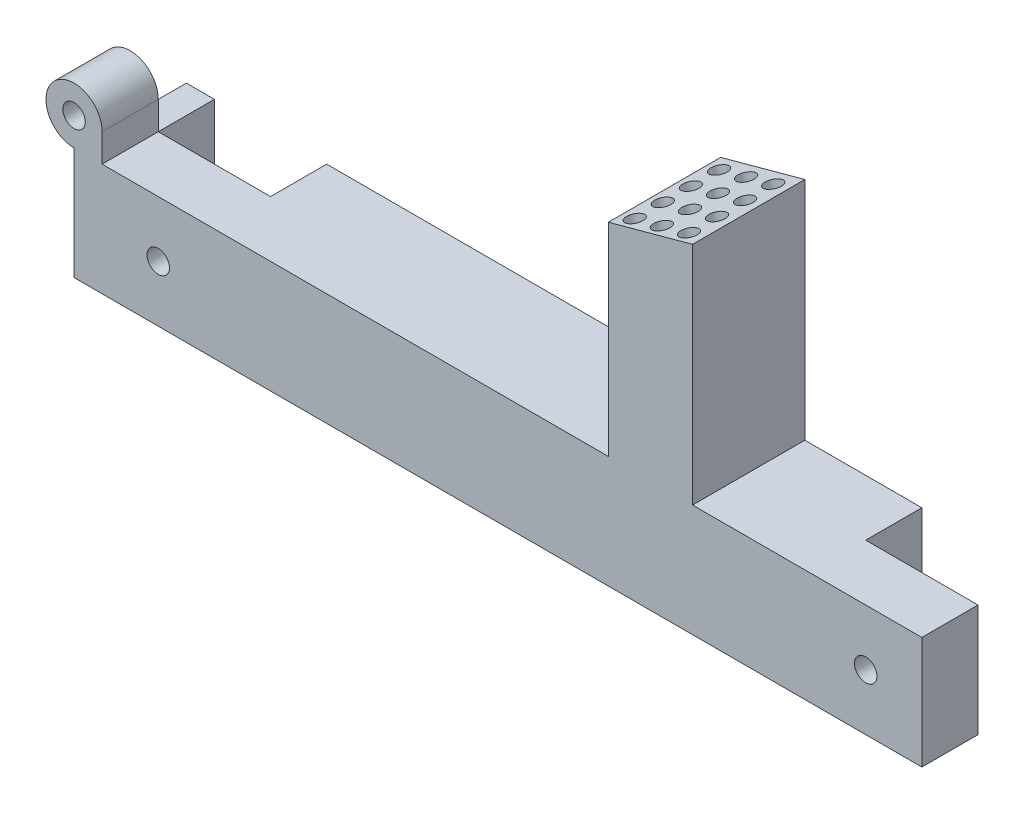
ISO-10303-21;
HEADER;
FILE_DESCRIPTION(('STEP AP214'),'2;1');
FILE_NAME('part.step','',(''),(''),'','','');
FILE_SCHEMA(('AUTOMOTIVE_DESIGN { 1 0 10303 214 1 1 1 1 }'));
ENDSEC;
DATA;
#1=APPLICATION_CONTEXT('core data for automotive mechanical design processes');
#2=APPLICATION_PROTOCOL_DEFINITION('international standard','automotive_design',2000,#1);
#3=PRODUCT_CONTEXT('',#1,'mechanical');
#4=PRODUCT('Part','Part','',(#3));
#5=PRODUCT_RELATED_PRODUCT_CATEGORY('part','',(#4));
#6=PRODUCT_DEFINITION_FORMATION('','',#4);
#7=PRODUCT_DEFINITION_CONTEXT('part definition',#1,'design');
#8=PRODUCT_DEFINITION('design','',#6,#7);
#9=PRODUCT_DEFINITION_SHAPE('','',#8);
#10=(LENGTH_UNIT() NAMED_UNIT(*) SI_UNIT(.MILLI.,.METRE.));
#11=(NAMED_UNIT(*) PLANE_ANGLE_UNIT() SI_UNIT($,.RADIAN.));
#12=(NAMED_UNIT(*) SI_UNIT($,.STERADIAN.) SOLID_ANGLE_UNIT());
#13=UNCERTAINTY_MEASURE_WITH_UNIT(LENGTH_MEASURE(1.E-05),#10,'distance_accuracy_value','');
#14=(GEOMETRIC_REPRESENTATION_CONTEXT(3) GLOBAL_UNCERTAINTY_ASSIGNED_CONTEXT((#13)) GLOBAL_UNIT_ASSIGNED_CONTEXT((#10,
#11,#12)) REPRESENTATION_CONTEXT('',''));
#15=CARTESIAN_POINT('',(0.,0.,0.));
#16=DIRECTION('',(0.,0.,1.));
#17=DIRECTION('',(1.,0.,0.));
#18=AXIS2_PLACEMENT_3D('',#15,#16,#17);
#19=CARTESIAN_POINT('',(-122.5,20.,20.));
#20=DIRECTION('',(0.,-1.,0.));
#21=DIRECTION('',(1.,0.,0.));
#22=AXIS2_PLACEMENT_3D('',#19,#20,#21);
#23=PLANE('',#22);
#24=DIRECTION('',(-1.,0.,0.));
#25=VECTOR('',#24,1.);
#26=CARTESIAN_POINT('',(-122.5,20.,0.));
#27=LINE('',#26,#25);
#28=CARTESIAN_POINT('',(126.,20.,0.));
#29=VERTEX_POINT('',#28);
#30=CARTESIAN_POINT('',(105.163576310592,20.,0.));
#31=VERTEX_POINT('',#30);
#32=EDGE_CURVE('E287',#29,#31,#27,.T.);
#33=ORIENTED_EDGE('',*,*,#32,.T.);
#34=DIRECTION('',(0.,0.,1.));
#35=VECTOR('',#34,1.);
#36=CARTESIAN_POINT('',(105.163576310592,20.,-42.9228270218909));
#37=LINE('',#36,#35);
#38=CARTESIAN_POINT('',(105.163576310592,20.,20.));
#39=VERTEX_POINT('',#38);
#40=EDGE_CURVE('E59',#31,#39,#37,.T.);
#41=ORIENTED_EDGE('',*,*,#40,.T.);
#42=DIRECTION('',(-1.,0.,0.));
#43=VECTOR('',#42,1.);
#44=CARTESIAN_POINT('',(-122.5,20.,20.));
#45=LINE('',#44,#43);
#46=CARTESIAN_POINT('',(146.,20.,20.));
#47=VERTEX_POINT('',#46);
#48=EDGE_CURVE('E281',#47,#39,#45,.T.);
#49=ORIENTED_EDGE('',*,*,#48,.F.);
#50=DIRECTION('',(0.,0.,1.));
#51=VECTOR('',#50,1.);
#52=CARTESIAN_POINT('',(146.,20.,-147.363496158309));
#53=LINE('',#52,#51);
#54=CARTESIAN_POINT('',(146.,20.,10.));
#55=VERTEX_POINT('',#54);
#56=EDGE_CURVE('E216',#55,#47,#53,.T.);
#57=ORIENTED_EDGE('',*,*,#56,.F.);
#58=DIRECTION('',(1.,0.,0.));
#59=VECTOR('',#58,1.);
#60=CARTESIAN_POINT('',(146.,20.,10.));
#61=LINE('',#60,#59);
#62=CARTESIAN_POINT('',(126.,20.,10.));
#63=VERTEX_POINT('',#62);
#64=EDGE_CURVE('E252',#63,#55,#61,.T.);
#65=ORIENTED_EDGE('',*,*,#64,.F.);
#66=DIRECTION('',(0.,0.,1.));
#67=VECTOR('',#66,1.);
#68=CARTESIAN_POINT('',(126.,20.,0.));
#69=LINE('',#68,#67);
#70=EDGE_CURVE('E246',#29,#63,#69,.T.);
#71=ORIENTED_EDGE('',*,*,#70,.F.);
#72=EDGE_LOOP('',(#33,#41,#49,#57,#65,#71));
#73=FACE_BOUND('',#72,.T.);
#74=ADVANCED_FACE('F34',(#73),#23,.F.);
#75=CARTESIAN_POINT('',(90.1635763105918,20.,20.));
#76=VERTEX_POINT('',#75);
#77=CARTESIAN_POINT('',(0.,20.,20.));
#78=VERTEX_POINT('',#77);
#79=EDGE_CURVE('E51',#76,#78,#45,.T.);
#80=ORIENTED_EDGE('',*,*,#79,.F.);
#81=DIRECTION('',(0.,0.,1.));
#82=VECTOR('',#81,1.);
#83=CARTESIAN_POINT('',(90.1635763105918,20.,-42.9228270218909));
#84=LINE('',#83,#82);
#85=CARTESIAN_POINT('',(90.1635763105918,20.,0.));
#86=VERTEX_POINT('',#85);
#87=EDGE_CURVE('E182',#86,#76,#84,.T.);
#88=ORIENTED_EDGE('',*,*,#87,.F.);
#89=CARTESIAN_POINT('',(20.,20.,0.));
#90=VERTEX_POINT('',#89);
#91=EDGE_CURVE('E284',#86,#90,#27,.T.);
#92=ORIENTED_EDGE('',*,*,#91,.T.);
#93=DIRECTION('',(0.,0.,-1.));
#94=VECTOR('',#93,1.);
#95=CARTESIAN_POINT('',(20.,20.,0.));
#96=LINE('',#95,#94);
#97=CARTESIAN_POINT('',(20.,20.,10.));
#98=VERTEX_POINT('',#97);
#99=EDGE_CURVE('E239',#98,#90,#96,.T.);
#100=ORIENTED_EDGE('',*,*,#99,.F.);
#101=DIRECTION('',(1.,0.,0.));
#102=VECTOR('',#101,1.);
#103=CARTESIAN_POINT('',(20.,20.,10.));
#104=LINE('',#103,#102);
#105=CARTESIAN_POINT('',(0.,20.,10.));
#106=VERTEX_POINT('',#105);
#107=EDGE_CURVE('E225',#106,#98,#104,.T.);
#108=ORIENTED_EDGE('',*,*,#107,.F.);
#109=DIRECTION('',(0.,0.,1.));
#110=VECTOR('',#109,1.);
#111=CARTESIAN_POINT('',(0.,20.,-4.14213562373095));
#112=LINE('',#111,#110);
#113=EDGE_CURVE('E207',#106,#78,#112,.T.);
#114=ORIENTED_EDGE('',*,*,#113,.T.);
#115=EDGE_LOOP('',(#80,#88,#92,#100,#108,#114));
#116=FACE_BOUND('',#115,.T.);
#117=ADVANCED_FACE('F293',(#116),#23,.F.);
#118=DIRECTION('',(1.,0.,0.));
#119=VECTOR('',#118,1.);
#120=CARTESIAN_POINT('',(0.,20.,10.));
#121=LINE('',#120,#119);
#122=CARTESIAN_POINT('',(-5.,20.,10.));
#123=VERTEX_POINT('',#122);
#124=EDGE_CURVE('E198',#123,#106,#121,.T.);
#125=ORIENTED_EDGE('',*,*,#124,.T.);
#126=DIRECTION('',(0.,0.,1.));
#127=VECTOR('',#126,1.);
#128=CARTESIAN_POINT('',(0.,20.,0.));
#129=LINE('',#128,#127);
#130=CARTESIAN_POINT('',(0.,20.,0.));
#131=VERTEX_POINT('',#130);
#132=EDGE_CURVE('E236',#131,#106,#129,.T.);
#133=ORIENTED_EDGE('',*,*,#132,.F.);
#134=CARTESIAN_POINT('',(-5.,20.,0.));
#135=VERTEX_POINT('',#134);
#136=EDGE_CURVE('E285',#131,#135,#27,.T.);
#137=ORIENTED_EDGE('',*,*,#136,.T.);
#138=DIRECTION('',(0.,0.,-1.));
#139=VECTOR('',#138,1.);
#140=CARTESIAN_POINT('',(-5.,20.,20.));
#141=LINE('',#140,#139);
#142=EDGE_CURVE('E201',#123,#135,#141,.T.);
#143=ORIENTED_EDGE('',*,*,#142,.F.);
#144=EDGE_LOOP('',(#125,#133,#137,#143));
#145=FACE_BOUND('',#144,.T.);
#146=ADVANCED_FACE('F329',(#145),#23,.F.);
#147=CARTESIAN_POINT('',(-5.,-5.00999999999999,0.));
#148=DIRECTION('',(-1.,0.,0.));
#149=DIRECTION('',(0.,-1.,0.));
#150=AXIS2_PLACEMENT_3D('',#147,#148,#149);
#151=PLANE('',#150);
#152=DIRECTION('',(0.,1.,0.));
#153=VECTOR('',#152,1.);
#154=CARTESIAN_POINT('',(-5.,-10.,0.));
#155=LINE('',#154,#153);
#156=CARTESIAN_POINT('',(-5.,0.,0.));
#157=VERTEX_POINT('',#156);
#158=EDGE_CURVE('E271',#157,#135,#155,.T.);
#159=ORIENTED_EDGE('',*,*,#158,.F.);
#160=DIRECTION('',(0.,0.,1.));
#161=VECTOR('',#160,1.);
#162=CARTESIAN_POINT('',(-5.,0.,20.));
#163=LINE('',#162,#161);
#164=CARTESIAN_POINT('',(-5.,0.,20.));
#165=VERTEX_POINT('',#164);
#166=EDGE_CURVE('E276',#157,#165,#163,.T.);
#167=ORIENTED_EDGE('',*,*,#166,.T.);
#168=DIRECTION('',(0.,1.,0.));
#169=VECTOR('',#168,1.);
#170=CARTESIAN_POINT('',(-5.,-10.,20.));
#171=LINE('',#170,#169);
#172=CARTESIAN_POINT('',(-5.,20.,20.));
#173=VERTEX_POINT('',#172);
#174=EDGE_CURVE('E274',#165,#173,#171,.T.);
#175=ORIENTED_EDGE('',*,*,#174,.T.);
#176=EDGE_CURVE('E279',#173,#123,#141,.T.);
#177=ORIENTED_EDGE('',*,*,#176,.T.);
#178=ORIENTED_EDGE('',*,*,#142,.T.);
#179=EDGE_LOOP('',(#159,#167,#175,#177,#178));
#180=FACE_BOUND('',#179,.T.);
#181=ADVANCED_FACE('F328',(#180),#151,.T.);
#182=CARTESIAN_POINT('',(-122.5,-10.,20.));
#183=DIRECTION('',(0.,0.,-1.));
#184=DIRECTION('',(-1.,0.,0.));
#185=AXIS2_PLACEMENT_3D('',#182,#183,#184);
#186=PLANE('',#185);
#187=CARTESIAN_POINT('',(-5.,25.,20.));
#188=DIRECTION('',(0.,0.,1.));
#189=DIRECTION('',(1.,0.,0.));
#190=AXIS2_PLACEMENT_3D('',#187,#188,#189);
#191=CIRCLE('',#190,2.);
#192=CARTESIAN_POINT('',(-3.,25.,20.));
#193=VERTEX_POINT('',#192);
#194=EDGE_CURVE('E187',#193,#193,#191,.T.);
#195=ORIENTED_EDGE('',*,*,#194,.F.);
#196=EDGE_LOOP('',(#195));
#197=FACE_BOUND('',#196,.T.);
#198=CARTESIAN_POINT('',(10.,10.,20.));
#199=DIRECTION('',(0.,0.,-1.));
#200=DIRECTION('',(-1.,0.,0.));
#201=AXIS2_PLACEMENT_3D('',#198,#199,#200);
#202=CIRCLE('',#201,2.);
#203=CARTESIAN_POINT('',(8.00000000000001,10.,20.));
#204=VERTEX_POINT('',#203);
#205=EDGE_CURVE('E43',#204,#204,#202,.F.);
#206=ORIENTED_EDGE('',*,*,#205,.F.);
#207=EDGE_LOOP('',(#206));
#208=FACE_BOUND('',#207,.T.);
#209=CARTESIAN_POINT('',(136.,10.,20.));
#210=DIRECTION('',(0.,0.,-1.));
#211=DIRECTION('',(-1.,0.,0.));
#212=AXIS2_PLACEMENT_3D('',#209,#210,#211);
#213=CIRCLE('',#212,2.);
#214=CARTESIAN_POINT('',(134.,10.,20.));
#215=VERTEX_POINT('',#214);
#216=EDGE_CURVE('E242',#215,#215,#213,.F.);
#217=ORIENTED_EDGE('',*,*,#216,.F.);
#218=EDGE_LOOP('',(#217));
#219=FACE_BOUND('',#218,.T.);
#220=ORIENTED_EDGE('',*,*,#174,.F.);
#221=DIRECTION('',(1.,0.,0.));
#222=VECTOR('',#221,1.);
#223=CARTESIAN_POINT('',(0.,0.,20.));
#224=LINE('',#223,#222);
#225=CARTESIAN_POINT('',(146.,0.,20.));
#226=VERTEX_POINT('',#225);
#227=EDGE_CURVE('E283',#165,#226,#224,.T.);
#228=ORIENTED_EDGE('',*,*,#227,.T.);
#229=DIRECTION('',(0.,1.,0.));
#230=VECTOR('',#229,1.);
#231=CARTESIAN_POINT('',(146.,0.,20.));
#232=LINE('',#231,#230);
#233=EDGE_CURVE('E215',#226,#47,#232,.T.);
#234=ORIENTED_EDGE('',*,*,#233,.T.);
#235=ORIENTED_EDGE('',*,*,#48,.T.);
#236=DIRECTION('',(0.,1.,0.));
#237=VECTOR('',#236,1.);
#238=CARTESIAN_POINT('',(105.163576310592,60.2165274427215,20.));
#239=LINE('',#238,#237);
#240=CARTESIAN_POINT('',(105.163576310592,60.2165274427215,20.));
#241=VERTEX_POINT('',#240);
#242=EDGE_CURVE('E180',#39,#241,#239,.T.);
#243=ORIENTED_EDGE('',*,*,#242,.T.);
#244=DIRECTION('',(-0.964787323828813,-0.263031214457976,0.));
#245=VECTOR('',#244,1.);
#246=CARTESIAN_POINT('',(90.1635763105918,56.12705806494,20.));
#247=LINE('',#246,#245);
#248=CARTESIAN_POINT('',(90.1635763105918,56.12705806494,20.));
#249=VERTEX_POINT('',#248);
#250=EDGE_CURVE('E168',#241,#249,#247,.T.);
#251=ORIENTED_EDGE('',*,*,#250,.T.);
#252=DIRECTION('',(0.,-1.,0.));
#253=VECTOR('',#252,1.);
#254=CARTESIAN_POINT('',(90.1635763105918,20.,20.));
#255=LINE('',#254,#253);
#256=EDGE_CURVE('E174',#249,#76,#255,.T.);
#257=ORIENTED_EDGE('',*,*,#256,.T.);
#258=ORIENTED_EDGE('',*,*,#79,.T.);
#259=DIRECTION('',(0.,-1.,0.));
#260=VECTOR('',#259,1.);
#261=CARTESIAN_POINT('',(0.,0.,20.));
#262=LINE('',#261,#260);
#263=CARTESIAN_POINT('',(0.,25.,20.));
#264=VERTEX_POINT('',#263);
#265=EDGE_CURVE('E204',#264,#78,#262,.T.);
#266=ORIENTED_EDGE('',*,*,#265,.F.);
#267=CARTESIAN_POINT('',(-5.,25.,20.));
#268=DIRECTION('',(0.,0.,1.));
#269=DIRECTION('',(1.,0.,0.));
#270=AXIS2_PLACEMENT_3D('',#267,#268,#269);
#271=CIRCLE('',#270,5.);
#272=EDGE_CURVE('E193',#173,#264,#271,.F.);
#273=ORIENTED_EDGE('',*,*,#272,.F.);
#274=EDGE_LOOP('',(#220,#228,#234,#235,#243,#251,#257,#258,#266,#273));
#275=FACE_BOUND('',#274,.T.);
#276=ADVANCED_FACE('F322',(#197,#208,#219,#275),#186,.F.);
#277=CARTESIAN_POINT('',(-122.5,-10.,0.));
#278=DIRECTION('',(0.,0.,-1.));
#279=DIRECTION('',(-1.,0.,0.));
#280=AXIS2_PLACEMENT_3D('',#277,#278,#279);
#281=PLANE('',#280);
#282=DIRECTION('',(1.,0.,0.));
#283=VECTOR('',#282,1.);
#284=CARTESIAN_POINT('',(0.,0.,0.));
#285=LINE('',#284,#283);
#286=CARTESIAN_POINT('',(0.,0.,0.));
#287=VERTEX_POINT('',#286);
#288=EDGE_CURVE('E38',#157,#287,#285,.T.);
#289=ORIENTED_EDGE('',*,*,#288,.F.);
#290=ORIENTED_EDGE('',*,*,#158,.T.);
#291=ORIENTED_EDGE('',*,*,#136,.F.);
#292=DIRECTION('',(0.,1.,0.));
#293=VECTOR('',#292,1.);
#294=CARTESIAN_POINT('',(0.,-22.3606797749979,0.));
#295=LINE('',#294,#293);
#296=EDGE_CURVE('E226',#287,#131,#295,.T.);
#297=ORIENTED_EDGE('',*,*,#296,.F.);
#298=EDGE_LOOP('',(#289,#290,#291,#297));
#299=FACE_BOUND('',#298,.T.);
#300=ADVANCED_FACE('F333',(#299),#281,.T.);
#301=CARTESIAN_POINT('',(0.,0.,20.));
#302=DIRECTION('',(0.,1.,0.));
#303=DIRECTION('',(-1.,0.,0.));
#304=AXIS2_PLACEMENT_3D('',#301,#302,#303);
#305=PLANE('',#304);
#306=ORIENTED_EDGE('',*,*,#166,.F.);
#307=ORIENTED_EDGE('',*,*,#288,.T.);
#308=DIRECTION('',(0.,0.,-1.));
#309=VECTOR('',#308,1.);
#310=CARTESIAN_POINT('',(0.,0.,0.));
#311=LINE('',#310,#309);
#312=CARTESIAN_POINT('',(0.,0.,10.));
#313=VERTEX_POINT('',#312);
#314=EDGE_CURVE('E233',#313,#287,#311,.T.);
#315=ORIENTED_EDGE('',*,*,#314,.F.);
#316=DIRECTION('',(-1.,0.,0.));
#317=VECTOR('',#316,1.);
#318=CARTESIAN_POINT('',(20.,0.,10.));
#319=LINE('',#318,#317);
#320=CARTESIAN_POINT('',(20.,0.,10.));
#321=VERTEX_POINT('',#320);
#322=EDGE_CURVE('E245',#321,#313,#319,.T.);
#323=ORIENTED_EDGE('',*,*,#322,.F.);
#324=DIRECTION('',(0.,0.,1.));
#325=VECTOR('',#324,1.);
#326=CARTESIAN_POINT('',(20.,0.,0.));
#327=LINE('',#326,#325);
#328=CARTESIAN_POINT('',(20.,0.,0.));
#329=VERTEX_POINT('',#328);
#330=EDGE_CURVE('E243',#329,#321,#327,.T.);
#331=ORIENTED_EDGE('',*,*,#330,.F.);
#332=CARTESIAN_POINT('',(126.,0.,0.));
#333=VERTEX_POINT('',#332);
#334=EDGE_CURVE('E218',#329,#333,#285,.T.);
#335=ORIENTED_EDGE('',*,*,#334,.T.);
#336=DIRECTION('',(0.,0.,-1.));
#337=VECTOR('',#336,1.);
#338=CARTESIAN_POINT('',(126.,0.,0.));
#339=LINE('',#338,#337);
#340=CARTESIAN_POINT('',(126.,0.,10.));
#341=VERTEX_POINT('',#340);
#342=EDGE_CURVE('E258',#341,#333,#339,.T.);
#343=ORIENTED_EDGE('',*,*,#342,.F.);
#344=DIRECTION('',(-1.,0.,0.));
#345=VECTOR('',#344,1.);
#346=CARTESIAN_POINT('',(146.,0.,10.));
#347=LINE('',#346,#345);
#348=CARTESIAN_POINT('',(146.,0.,10.));
#349=VERTEX_POINT('',#348);
#350=EDGE_CURVE('E221',#349,#341,#347,.T.);
#351=ORIENTED_EDGE('',*,*,#350,.F.);
#352=DIRECTION('',(0.,0.,1.));
#353=VECTOR('',#352,1.);
#354=CARTESIAN_POINT('',(146.,0.,-147.363496158309));
#355=LINE('',#354,#353);
#356=EDGE_CURVE('E212',#349,#226,#355,.T.);
#357=ORIENTED_EDGE('',*,*,#356,.T.);
#358=ORIENTED_EDGE('',*,*,#227,.F.);
#359=EDGE_LOOP('',(#306,#307,#315,#323,#331,#335,#343,#351,#357,#358));
#360=FACE_BOUND('',#359,.T.);
#361=ADVANCED_FACE('F36',(#360),#305,.F.);
#362=DIRECTION('',(0.,1.,0.));
#363=VECTOR('',#362,1.);
#364=CARTESIAN_POINT('',(126.,-22.3606797749979,0.));
#365=LINE('',#364,#363);
#366=EDGE_CURVE('E250',#333,#29,#365,.T.);
#367=ORIENTED_EDGE('',*,*,#366,.F.);
#368=ORIENTED_EDGE('',*,*,#334,.F.);
#369=DIRECTION('',(0.,1.,0.));
#370=VECTOR('',#369,1.);
#371=CARTESIAN_POINT('',(20.,-22.3606797749979,0.));
#372=LINE('',#371,#370);
#373=EDGE_CURVE('E222',#329,#90,#372,.T.);
#374=ORIENTED_EDGE('',*,*,#373,.T.);
#375=ORIENTED_EDGE('',*,*,#91,.F.);
#376=DIRECTION('',(0.,-1.,0.));
#377=VECTOR('',#376,1.);
#378=CARTESIAN_POINT('',(90.1635763105918,20.,0.));
#379=LINE('',#378,#377);
#380=CARTESIAN_POINT('',(90.1635763105918,56.12705806494,0.));
#381=VERTEX_POINT('',#380);
#382=EDGE_CURVE('E159',#381,#86,#379,.T.);
#383=ORIENTED_EDGE('',*,*,#382,.F.);
#384=DIRECTION('',(-0.964787323828813,-0.263031214457976,0.));
#385=VECTOR('',#384,1.);
#386=CARTESIAN_POINT('',(90.1635763105918,56.12705806494,0.));
#387=LINE('',#386,#385);
#388=CARTESIAN_POINT('',(105.163576310592,60.2165274427215,0.));
#389=VERTEX_POINT('',#388);
#390=EDGE_CURVE('E151',#389,#381,#387,.T.);
#391=ORIENTED_EDGE('',*,*,#390,.F.);
#392=DIRECTION('',(0.,1.,0.));
#393=VECTOR('',#392,1.);
#394=CARTESIAN_POINT('',(105.163576310592,60.2165274427215,0.));
#395=LINE('',#394,#393);
#396=EDGE_CURVE('E157',#31,#389,#395,.T.);
#397=ORIENTED_EDGE('',*,*,#396,.F.);
#398=ORIENTED_EDGE('',*,*,#32,.F.);
#399=EDGE_LOOP('',(#367,#368,#374,#375,#383,#391,#397,#398));
#400=FACE_BOUND('',#399,.T.);
#401=ADVANCED_FACE('F154',(#400),#281,.T.);
#402=CARTESIAN_POINT('',(146.,0.,-147.363496158309));
#403=DIRECTION('',(1.,0.,0.));
#404=DIRECTION('',(0.,0.,-1.));
#405=AXIS2_PLACEMENT_3D('',#402,#403,#404);
#406=PLANE('',#405);
#407=DIRECTION('',(0.,1.,0.));
#408=VECTOR('',#407,1.);
#409=CARTESIAN_POINT('',(146.,-22.3606797749979,10.));
#410=LINE('',#409,#408);
#411=EDGE_CURVE('E255',#349,#55,#410,.T.);
#412=ORIENTED_EDGE('',*,*,#411,.T.);
#413=ORIENTED_EDGE('',*,*,#56,.T.);
#414=ORIENTED_EDGE('',*,*,#233,.F.);
#415=ORIENTED_EDGE('',*,*,#356,.F.);
#416=EDGE_LOOP('',(#412,#413,#414,#415));
#417=FACE_BOUND('',#416,.T.);
#418=ADVANCED_FACE('F337',(#417),#406,.T.);
#419=CARTESIAN_POINT('',(146.,-22.3606797749979,10.));
#420=DIRECTION('',(0.,0.,1.));
#421=DIRECTION('',(1.,0.,0.));
#422=AXIS2_PLACEMENT_3D('',#419,#420,#421);
#423=PLANE('',#422);
#424=CARTESIAN_POINT('',(136.,10.,9.99999999999999));
#425=DIRECTION('',(0.,0.,-1.));
#426=DIRECTION('',(-1.,0.,0.));
#427=AXIS2_PLACEMENT_3D('',#424,#425,#426);
#428=CIRCLE('',#427,2.);
#429=CARTESIAN_POINT('',(134.,10.,9.99999999999999));
#430=VERTEX_POINT('',#429);
#431=EDGE_CURVE('E265',#430,#430,#428,.T.);
#432=ORIENTED_EDGE('',*,*,#431,.F.);
#433=EDGE_LOOP('',(#432));
#434=FACE_BOUND('',#433,.T.);
#435=ORIENTED_EDGE('',*,*,#350,.T.);
#436=DIRECTION('',(0.,1.,0.));
#437=VECTOR('',#436,1.);
#438=CARTESIAN_POINT('',(126.,-22.3606797749979,10.));
#439=LINE('',#438,#437);
#440=EDGE_CURVE('E253',#341,#63,#439,.T.);
#441=ORIENTED_EDGE('',*,*,#440,.T.);
#442=ORIENTED_EDGE('',*,*,#64,.T.);
#443=ORIENTED_EDGE('',*,*,#411,.F.);
#444=EDGE_LOOP('',(#435,#441,#442,#443));
#445=FACE_BOUND('',#444,.T.);
#446=ADVANCED_FACE('F369',(#434,#445),#423,.F.);
#447=CARTESIAN_POINT('',(126.,-22.3606797749979,0.));
#448=DIRECTION('',(-1.,0.,0.));
#449=DIRECTION('',(0.,-1.,0.));
#450=AXIS2_PLACEMENT_3D('',#447,#448,#449);
#451=PLANE('',#450);
#452=ORIENTED_EDGE('',*,*,#342,.T.);
#453=ORIENTED_EDGE('',*,*,#366,.T.);
#454=ORIENTED_EDGE('',*,*,#70,.T.);
#455=ORIENTED_EDGE('',*,*,#440,.F.);
#456=EDGE_LOOP('',(#452,#453,#454,#455));
#457=FACE_BOUND('',#456,.T.);
#458=ADVANCED_FACE('F372',(#457),#451,.F.);
#459=CARTESIAN_POINT('',(20.,-22.3606797749979,0.));
#460=DIRECTION('',(1.,0.,0.));
#461=DIRECTION('',(0.,0.,-1.));
#462=AXIS2_PLACEMENT_3D('',#459,#460,#461);
#463=PLANE('',#462);
#464=ORIENTED_EDGE('',*,*,#330,.T.);
#465=DIRECTION('',(0.,1.,0.));
#466=VECTOR('',#465,1.);
#467=CARTESIAN_POINT('',(20.,-22.3606797749979,10.));
#468=LINE('',#467,#466);
#469=EDGE_CURVE('E231',#321,#98,#468,.T.);
#470=ORIENTED_EDGE('',*,*,#469,.T.);
#471=ORIENTED_EDGE('',*,*,#99,.T.);
#472=ORIENTED_EDGE('',*,*,#373,.F.);
#473=EDGE_LOOP('',(#464,#470,#471,#472));
#474=FACE_BOUND('',#473,.T.);
#475=ADVANCED_FACE('F296',(#474),#463,.F.);
#476=CARTESIAN_POINT('',(20.,-22.3606797749979,10.));
#477=DIRECTION('',(0.,0.,1.));
#478=DIRECTION('',(1.,0.,0.));
#479=AXIS2_PLACEMENT_3D('',#476,#477,#478);
#480=PLANE('',#479);
#481=CARTESIAN_POINT('',(10.,10.,10.));
#482=DIRECTION('',(0.,0.,-1.));
#483=DIRECTION('',(-1.,0.,0.));
#484=AXIS2_PLACEMENT_3D('',#481,#482,#483);
#485=CIRCLE('',#484,2.);
#486=CARTESIAN_POINT('',(8.00000000000001,10.,10.));
#487=VERTEX_POINT('',#486);
#488=EDGE_CURVE('E11',#487,#487,#485,.T.);
#489=ORIENTED_EDGE('',*,*,#488,.F.);
#490=EDGE_LOOP('',(#489));
#491=FACE_BOUND('',#490,.T.);
#492=ORIENTED_EDGE('',*,*,#322,.T.);
#493=DIRECTION('',(0.,1.,0.));
#494=VECTOR('',#493,1.);
#495=CARTESIAN_POINT('',(0.,-22.3606797749979,10.));
#496=LINE('',#495,#494);
#497=EDGE_CURVE('E228',#313,#106,#496,.T.);
#498=ORIENTED_EDGE('',*,*,#497,.T.);
#499=ORIENTED_EDGE('',*,*,#107,.T.);
#500=ORIENTED_EDGE('',*,*,#469,.F.);
#501=EDGE_LOOP('',(#492,#498,#499,#500));
#502=FACE_BOUND('',#501,.T.);
#503=ADVANCED_FACE('F308',(#491,#502),#480,.F.);
#504=CARTESIAN_POINT('',(0.,-22.3606797749979,0.));
#505=DIRECTION('',(-1.,0.,0.));
#506=DIRECTION('',(0.,-1.,0.));
#507=AXIS2_PLACEMENT_3D('',#504,#505,#506);
#508=PLANE('',#507);
#509=ORIENTED_EDGE('',*,*,#314,.T.);
#510=ORIENTED_EDGE('',*,*,#296,.T.);
#511=ORIENTED_EDGE('',*,*,#132,.T.);
#512=ORIENTED_EDGE('',*,*,#497,.F.);
#513=EDGE_LOOP('',(#509,#510,#511,#512));
#514=FACE_BOUND('',#513,.T.);
#515=ADVANCED_FACE('F367',(#514),#508,.F.);
#516=CARTESIAN_POINT('',(10.,10.,25.6568542494924));
#517=DIRECTION('',(0.,0.,-1.));
#518=DIRECTION('',(-1.,0.,0.));
#519=AXIS2_PLACEMENT_3D('',#516,#517,#518);
#520=CYLINDRICAL_SURFACE('',#519,2.);
#521=ORIENTED_EDGE('',*,*,#205,.T.);
#522=EDGE_LOOP('',(#521));
#523=FACE_BOUND('',#522,.T.);
#524=ORIENTED_EDGE('',*,*,#488,.T.);
#525=EDGE_LOOP('',(#524));
#526=FACE_BOUND('',#525,.T.);
#527=ADVANCED_FACE('F363',(#523,#526),#520,.F.);
#528=CARTESIAN_POINT('',(136.,10.,25.6568542494924));
#529=DIRECTION('',(0.,0.,-1.));
#530=DIRECTION('',(-1.,0.,0.));
#531=AXIS2_PLACEMENT_3D('',#528,#529,#530);
#532=CYLINDRICAL_SURFACE('',#531,2.);
#533=ORIENTED_EDGE('',*,*,#216,.T.);
#534=EDGE_LOOP('',(#533));
#535=FACE_BOUND('',#534,.T.);
#536=ORIENTED_EDGE('',*,*,#431,.T.);
#537=EDGE_LOOP('',(#536));
#538=FACE_BOUND('',#537,.T.);
#539=ADVANCED_FACE('F351',(#535,#538),#532,.F.);
#540=CARTESIAN_POINT('',(0.,0.,-4.14213562373095));
#541=DIRECTION('',(-1.,0.,0.));
#542=DIRECTION('',(0.,-1.,0.));
#543=AXIS2_PLACEMENT_3D('',#540,#541,#542);
#544=PLANE('',#543);
#545=ORIENTED_EDGE('',*,*,#113,.F.);
#546=DIRECTION('',(0.,1.,0.));
#547=VECTOR('',#546,1.);
#548=CARTESIAN_POINT('',(0.,0.,10.));
#549=LINE('',#548,#547);
#550=CARTESIAN_POINT('',(0.,25.,10.));
#551=VERTEX_POINT('',#550);
#552=EDGE_CURVE('E194',#106,#551,#549,.T.);
#553=ORIENTED_EDGE('',*,*,#552,.T.);
#554=DIRECTION('',(0.,0.,1.));
#555=VECTOR('',#554,1.);
#556=CARTESIAN_POINT('',(0.,25.,-4.14213562373095));
#557=LINE('',#556,#555);
#558=EDGE_CURVE('E208',#551,#264,#557,.T.);
#559=ORIENTED_EDGE('',*,*,#558,.T.);
#560=ORIENTED_EDGE('',*,*,#265,.T.);
#561=EDGE_LOOP('',(#545,#553,#559,#560));
#562=FACE_BOUND('',#561,.T.);
#563=ADVANCED_FACE('F317',(#562),#544,.F.);
#564=CARTESIAN_POINT('',(-5.,25.,-4.14213562373095));
#565=DIRECTION('',(0.,0.,1.));
#566=DIRECTION('',(1.,0.,0.));
#567=AXIS2_PLACEMENT_3D('',#564,#565,#566);
#568=CYLINDRICAL_SURFACE('',#567,5.);
#569=ORIENTED_EDGE('',*,*,#558,.F.);
#570=CARTESIAN_POINT('',(-5.,25.,10.));
#571=DIRECTION('',(0.,0.,1.));
#572=DIRECTION('',(1.,0.,0.));
#573=AXIS2_PLACEMENT_3D('',#570,#571,#572);
#574=CIRCLE('',#573,5.);
#575=EDGE_CURVE('E197',#551,#123,#574,.T.);
#576=ORIENTED_EDGE('',*,*,#575,.T.);
#577=ORIENTED_EDGE('',*,*,#176,.F.);
#578=ORIENTED_EDGE('',*,*,#272,.T.);
#579=EDGE_LOOP('',(#569,#576,#577,#578));
#580=FACE_BOUND('',#579,.T.);
#581=ADVANCED_FACE('F325',(#580),#568,.T.);
#582=CARTESIAN_POINT('',(20.,-22.3606797749979,10.));
#583=DIRECTION('',(0.,0.,1.));
#584=DIRECTION('',(1.,0.,0.));
#585=AXIS2_PLACEMENT_3D('',#582,#583,#584);
#586=PLANE('',#585);
#587=CARTESIAN_POINT('',(-5.,25.,10.));
#588=DIRECTION('',(0.,0.,1.));
#589=DIRECTION('',(1.,0.,0.));
#590=AXIS2_PLACEMENT_3D('',#587,#588,#589);
#591=CIRCLE('',#590,2.);
#592=CARTESIAN_POINT('',(-3.,25.,10.));
#593=VERTEX_POINT('',#592);
#594=EDGE_CURVE('E190',#593,#593,#591,.F.);
#595=ORIENTED_EDGE('',*,*,#594,.F.);
#596=EDGE_LOOP('',(#595));
#597=FACE_BOUND('',#596,.T.);
#598=ORIENTED_EDGE('',*,*,#552,.F.);
#599=ORIENTED_EDGE('',*,*,#124,.F.);
#600=ORIENTED_EDGE('',*,*,#575,.F.);
#601=EDGE_LOOP('',(#598,#599,#600));
#602=FACE_BOUND('',#601,.T.);
#603=ADVANCED_FACE('F314',(#597,#602),#586,.F.);
#604=CARTESIAN_POINT('',(-5.,25.,4.34314575050762));
#605=DIRECTION('',(0.,0.,1.));
#606=DIRECTION('',(1.,0.,0.));
#607=AXIS2_PLACEMENT_3D('',#604,#605,#606);
#608=CYLINDRICAL_SURFACE('',#607,2.);
#609=ORIENTED_EDGE('',*,*,#594,.T.);
#610=EDGE_LOOP('',(#609));
#611=FACE_BOUND('',#610,.T.);
#612=ORIENTED_EDGE('',*,*,#194,.T.);
#613=EDGE_LOOP('',(#612));
#614=FACE_BOUND('',#613,.T.);
#615=ADVANCED_FACE('F392',(#611,#614),#608,.F.);
#616=CARTESIAN_POINT('',(105.163576310592,60.2165274427215,-42.9228270218909));
#617=DIRECTION('',(1.,0.,0.));
#618=DIRECTION('',(0.,1.,0.));
#619=AXIS2_PLACEMENT_3D('',#616,#617,#618);
#620=PLANE('',#619);
#621=ORIENTED_EDGE('',*,*,#40,.F.);
#622=ORIENTED_EDGE('',*,*,#396,.T.);
#623=DIRECTION('',(0.,0.,1.));
#624=VECTOR('',#623,1.);
#625=CARTESIAN_POINT('',(105.163576310592,60.2165274427215,-42.9228270218909));
#626=LINE('',#625,#624);
#627=EDGE_CURVE('E163',#389,#241,#626,.T.);
#628=ORIENTED_EDGE('',*,*,#627,.T.);
#629=ORIENTED_EDGE('',*,*,#242,.F.);
#630=EDGE_LOOP('',(#621,#622,#628,#629));
#631=FACE_BOUND('',#630,.T.);
#632=ADVANCED_FACE('F173',(#631),#620,.T.);
#633=CARTESIAN_POINT('',(90.1635763105918,56.12705806494,-42.9228270218909));
#634=DIRECTION('',(-0.263031214457976,0.964787323828813,0.));
#635=DIRECTION('',(-0.964787323828813,-0.263031214457976,0.));
#636=AXIS2_PLACEMENT_3D('',#633,#634,#635);
#637=PLANE('',#636);
#638=CARTESIAN_POINT('',(102.269214339106,59.4274337993476,17.75));
#639=DIRECTION('',(-0.263031214457976,0.964787323828813,0.));
#640=DIRECTION('',(-0.964787323828813,-0.263031214457976,0.));
#641=AXIS2_PLACEMENT_3D('',#638,#639,#640);
#642=CIRCLE('',#641,1.49999999999999);
#643=CARTESIAN_POINT('',(100.822033353362,59.0328869776606,17.75));
#644=VERTEX_POINT('',#643);
#645=EDGE_CURVE('E572',#644,#644,#642,.T.);
#646=ORIENTED_EDGE('',*,*,#645,.F.);
#647=EDGE_LOOP('',(#646));
#648=FACE_BOUND('',#647,.T.);
#649=CARTESIAN_POINT('',(102.269214339106,59.4274337993476,12.75));
#650=DIRECTION('',(-0.263031214457976,0.964787323828813,0.));
#651=DIRECTION('',(-0.964787323828813,-0.263031214457976,0.));
#652=AXIS2_PLACEMENT_3D('',#649,#650,#651);
#653=CIRCLE('',#652,1.49999999999999);
#654=CARTESIAN_POINT('',(100.822033353362,59.0328869776606,12.75));
#655=VERTEX_POINT('',#654);
#656=EDGE_CURVE('E566',#655,#655,#653,.T.);
#657=ORIENTED_EDGE('',*,*,#656,.F.);
#658=EDGE_LOOP('',(#657));
#659=FACE_BOUND('',#658,.T.);
#660=CARTESIAN_POINT('',(102.269214339105,59.4274337993476,7.75));
#661=DIRECTION('',(-0.263031214457976,0.964787323828813,0.));
#662=DIRECTION('',(-0.964787323828813,-0.263031214457976,0.));
#663=AXIS2_PLACEMENT_3D('',#660,#661,#662);
#664=CIRCLE('',#663,1.49999999999999);
#665=CARTESIAN_POINT('',(100.822033353362,59.0328869776606,7.75));
#666=VERTEX_POINT('',#665);
#667=EDGE_CURVE('E560',#666,#666,#664,.T.);
#668=ORIENTED_EDGE('',*,*,#667,.F.);
#669=EDGE_LOOP('',(#668));
#670=FACE_BOUND('',#669,.T.);
#671=CARTESIAN_POINT('',(92.6213411008175,56.7971216547679,17.7500000000001));
#672=DIRECTION('',(-0.263031214457976,0.964787323828813,0.));
#673=DIRECTION('',(-0.964787323828813,-0.263031214457976,0.));
#674=AXIS2_PLACEMENT_3D('',#671,#672,#673);
#675=CIRCLE('',#674,1.49999999999999);
#676=CARTESIAN_POINT('',(91.1741601150743,56.4025748330809,17.7500000000001));
#677=VERTEX_POINT('',#676);
#678=EDGE_CURVE('E554',#677,#677,#675,.T.);
#679=ORIENTED_EDGE('',*,*,#678,.F.);
#680=EDGE_LOOP('',(#679));
#681=FACE_BOUND('',#680,.T.);
#682=CARTESIAN_POINT('',(97.4452777199615,58.1122777270577,17.75));
#683=DIRECTION('',(-0.263031214457976,0.964787323828813,0.));
#684=DIRECTION('',(-0.964787323828813,-0.263031214457976,0.));
#685=AXIS2_PLACEMENT_3D('',#682,#683,#684);
#686=CIRCLE('',#685,1.49999999999999);
#687=CARTESIAN_POINT('',(95.9980967342183,57.7177309053708,17.75));
#688=VERTEX_POINT('',#687);
#689=EDGE_CURVE('E548',#688,#688,#686,.T.);
#690=ORIENTED_EDGE('',*,*,#689,.F.);
#691=EDGE_LOOP('',(#690));
#692=FACE_BOUND('',#691,.T.);
#693=CARTESIAN_POINT('',(92.6213411008174,56.7971216547678,12.7500000000001));
#694=DIRECTION('',(-0.263031214457976,0.964787323828813,0.));
#695=DIRECTION('',(-0.964787323828813,-0.263031214457976,0.));
#696=AXIS2_PLACEMENT_3D('',#693,#694,#695);
#697=CIRCLE('',#696,1.49999999999999);
#698=CARTESIAN_POINT('',(91.1741601150742,56.4025748330809,12.7500000000001));
#699=VERTEX_POINT('',#698);
#700=EDGE_CURVE('E542',#699,#699,#697,.T.);
#701=ORIENTED_EDGE('',*,*,#700,.F.);
#702=EDGE_LOOP('',(#701));
#703=FACE_BOUND('',#702,.T.);
#704=CARTESIAN_POINT('',(97.4452777199615,58.1122777270577,12.75));
#705=DIRECTION('',(-0.263031214457976,0.964787323828813,0.));
#706=DIRECTION('',(-0.964787323828813,-0.263031214457976,0.));
#707=AXIS2_PLACEMENT_3D('',#704,#705,#706);
#708=CIRCLE('',#707,1.49999999999999);
#709=CARTESIAN_POINT('',(95.9980967342183,57.7177309053707,12.75));
#710=VERTEX_POINT('',#709);
#711=EDGE_CURVE('E536',#710,#710,#708,.T.);
#712=ORIENTED_EDGE('',*,*,#711,.F.);
#713=EDGE_LOOP('',(#712));
#714=FACE_BOUND('',#713,.T.);
#715=CARTESIAN_POINT('',(92.6213411008174,56.7971216547678,7.75000000000007));
#716=DIRECTION('',(-0.263031214457976,0.964787323828813,0.));
#717=DIRECTION('',(-0.964787323828813,-0.263031214457976,0.));
#718=AXIS2_PLACEMENT_3D('',#715,#716,#717);
#719=CIRCLE('',#718,1.5);
#720=CARTESIAN_POINT('',(91.1741601150742,56.4025748330809,7.75000000000007));
#721=VERTEX_POINT('',#720);
#722=EDGE_CURVE('E530',#721,#721,#719,.T.);
#723=ORIENTED_EDGE('',*,*,#722,.F.);
#724=EDGE_LOOP('',(#723));
#725=FACE_BOUND('',#724,.T.);
#726=CARTESIAN_POINT('',(97.4452777199614,58.1122777270577,7.75000000000003));
#727=DIRECTION('',(-0.263031214457976,0.964787323828813,0.));
#728=DIRECTION('',(-0.964787323828813,-0.263031214457976,0.));
#729=AXIS2_PLACEMENT_3D('',#726,#727,#728);
#730=CIRCLE('',#729,1.49999999999999);
#731=CARTESIAN_POINT('',(95.9980967342182,57.7177309053707,7.75000000000003));
#732=VERTEX_POINT('',#731);
#733=EDGE_CURVE('E524',#732,#732,#730,.T.);
#734=ORIENTED_EDGE('',*,*,#733,.F.);
#735=EDGE_LOOP('',(#734));
#736=FACE_BOUND('',#735,.T.);
#737=CARTESIAN_POINT('',(92.6213411008173,56.7971216547678,2.75000000000007));
#738=DIRECTION('',(-0.263031214457976,0.964787323828813,0.));
#739=DIRECTION('',(-0.964787323828813,-0.263031214457976,0.));
#740=AXIS2_PLACEMENT_3D('',#737,#738,#739);
#741=CIRCLE('',#740,1.5);
#742=CARTESIAN_POINT('',(91.1741601150741,56.4025748330808,2.75000000000007));
#743=VERTEX_POINT('',#742);
#744=EDGE_CURVE('E518',#743,#743,#741,.T.);
#745=ORIENTED_EDGE('',*,*,#744,.F.);
#746=EDGE_LOOP('',(#745));
#747=FACE_BOUND('',#746,.T.);
#748=CARTESIAN_POINT('',(97.4452777199614,58.1122777270577,2.75000000000004));
#749=DIRECTION('',(-0.263031214457976,0.964787323828813,0.));
#750=DIRECTION('',(-0.964787323828813,-0.263031214457976,0.));
#751=AXIS2_PLACEMENT_3D('',#748,#749,#750);
#752=CIRCLE('',#751,1.5);
#753=CARTESIAN_POINT('',(95.9980967342181,57.7177309053707,2.75000000000004));
#754=VERTEX_POINT('',#753);
#755=EDGE_CURVE('E507',#754,#754,#752,.T.);
#756=ORIENTED_EDGE('',*,*,#755,.F.);
#757=EDGE_LOOP('',(#756));
#758=FACE_BOUND('',#757,.T.);
#759=CARTESIAN_POINT('',(102.269214339105,59.4274337993476,2.75));
#760=DIRECTION('',(-0.263031214457976,0.964787323828813,0.));
#761=DIRECTION('',(-0.964787323828813,-0.263031214457976,0.));
#762=AXIS2_PLACEMENT_3D('',#759,#760,#761);
#763=CIRCLE('',#762,1.5);
#764=CARTESIAN_POINT('',(100.822033353362,59.0328869776606,2.75));
#765=VERTEX_POINT('',#764);
#766=EDGE_CURVE('E506',#765,#765,#763,.T.);
#767=ORIENTED_EDGE('',*,*,#766,.F.);
#768=EDGE_LOOP('',(#767));
#769=FACE_BOUND('',#768,.T.);
#770=ORIENTED_EDGE('',*,*,#627,.F.);
#771=ORIENTED_EDGE('',*,*,#390,.T.);
#772=DIRECTION('',(0.,0.,1.));
#773=VECTOR('',#772,1.);
#774=CARTESIAN_POINT('',(90.1635763105918,56.12705806494,-42.9228270218909));
#775=LINE('',#774,#773);
#776=EDGE_CURVE('E162',#381,#249,#775,.T.);
#777=ORIENTED_EDGE('',*,*,#776,.T.);
#778=ORIENTED_EDGE('',*,*,#250,.F.);
#779=EDGE_LOOP('',(#770,#771,#777,#778));
#780=FACE_BOUND('',#779,.T.);
#781=ADVANCED_FACE('F166',(#648,#659,#670,#681,#692,#703,#714,#725,#736,#747,#758,#769,#780),
#637,.T.);
#782=CARTESIAN_POINT('',(90.1635763105918,20.,-42.9228270218909));
#783=DIRECTION('',(-1.,0.,0.));
#784=DIRECTION('',(0.,-1.,0.));
#785=AXIS2_PLACEMENT_3D('',#782,#783,#784);
#786=PLANE('',#785);
#787=ORIENTED_EDGE('',*,*,#776,.F.);
#788=ORIENTED_EDGE('',*,*,#382,.T.);
#789=ORIENTED_EDGE('',*,*,#87,.T.);
#790=ORIENTED_EDGE('',*,*,#256,.F.);
#791=EDGE_LOOP('',(#787,#788,#789,#790));
#792=FACE_BOUND('',#791,.T.);
#793=ADVANCED_FACE('F401',(#792),#786,.T.);
#794=CARTESIAN_POINT('',(102.92679237525,57.0154654897755,2.75));
#795=DIRECTION('',(-0.263031214457976,0.964787323828813,0.));
#796=DIRECTION('',(-0.964787323828813,-0.263031214457976,0.));
#797=AXIS2_PLACEMENT_3D('',#794,#795,#796);
#798=CYLINDRICAL_SURFACE('',#797,1.5);
#799=CARTESIAN_POINT('',(102.92679237525,57.0154654897755,2.75));
#800=DIRECTION('',(-0.263031214457976,0.964787323828813,0.));
#801=DIRECTION('',(-0.964787323828813,-0.263031214457976,0.));
#802=AXIS2_PLACEMENT_3D('',#799,#800,#801);
#803=CIRCLE('',#802,1.5);
#804=CARTESIAN_POINT('',(101.479611389507,56.6209186680886,2.75));
#805=VERTEX_POINT('',#804);
#806=EDGE_CURVE('E510',#805,#805,#803,.T.);
#807=ORIENTED_EDGE('',*,*,#806,.F.);
#808=EDGE_LOOP('',(#807));
#809=FACE_BOUND('',#808,.T.);
#810=ORIENTED_EDGE('',*,*,#766,.T.);
#811=EDGE_LOOP('',(#810));
#812=FACE_BOUND('',#811,.T.);
#813=ADVANCED_FACE('F405',(#809,#812),#798,.F.);
#814=CARTESIAN_POINT('',(102.92679237525,57.0154654897755,2.75));
#815=DIRECTION('',(-0.263031214457976,0.964787323828813,0.));
#816=DIRECTION('',(-0.964787323828813,-0.263031214457976,0.));
#817=AXIS2_PLACEMENT_3D('',#814,#815,#816);
#818=PLANE('',#817);
#819=ORIENTED_EDGE('',*,*,#806,.T.);
#820=EDGE_LOOP('',(#819));
#821=FACE_BOUND('',#820,.T.);
#822=ADVANCED_FACE('F409',(#821),#818,.T.);
#823=CARTESIAN_POINT('',(98.1028557561063,55.7003094174857,2.75000000000004));
#824=DIRECTION('',(-0.263031214457976,0.964787323828813,0.));
#825=DIRECTION('',(-0.964787323828813,-0.263031214457976,0.));
#826=AXIS2_PLACEMENT_3D('',#823,#824,#825);
#827=CYLINDRICAL_SURFACE('',#826,1.5);
#828=CARTESIAN_POINT('',(98.1028557561063,55.7003094174857,2.75000000000004));
#829=DIRECTION('',(-0.263031214457976,0.964787323828813,0.));
#830=DIRECTION('',(-0.964787323828813,-0.263031214457976,0.));
#831=AXIS2_PLACEMENT_3D('',#828,#829,#830);
#832=CIRCLE('',#831,1.5);
#833=CARTESIAN_POINT('',(96.6556747703631,55.3057625957987,2.75000000000004));
#834=VERTEX_POINT('',#833);
#835=EDGE_CURVE('E505',#834,#834,#832,.T.);
#836=ORIENTED_EDGE('',*,*,#835,.F.);
#837=EDGE_LOOP('',(#836));
#838=FACE_BOUND('',#837,.T.);
#839=ORIENTED_EDGE('',*,*,#755,.T.);
#840=EDGE_LOOP('',(#839));
#841=FACE_BOUND('',#840,.T.);
#842=ADVANCED_FACE('F413',(#838,#841),#827,.F.);
#843=CARTESIAN_POINT('',(98.1028557561063,55.7003094174857,2.75000000000004));
#844=DIRECTION('',(-0.263031214457976,0.964787323828813,0.));
#845=DIRECTION('',(-0.964787323828813,-0.263031214457976,0.));
#846=AXIS2_PLACEMENT_3D('',#843,#844,#845);
#847=PLANE('',#846);
#848=ORIENTED_EDGE('',*,*,#835,.T.);
#849=EDGE_LOOP('',(#848));
#850=FACE_BOUND('',#849,.T.);
#851=ADVANCED_FACE('F491',(#850),#847,.T.);
#852=CARTESIAN_POINT('',(93.2789191369623,54.3851533451958,2.75000000000007));
#853=DIRECTION('',(-0.263031214457976,0.964787323828813,0.));
#854=DIRECTION('',(-0.964787323828813,-0.263031214457976,0.));
#855=AXIS2_PLACEMENT_3D('',#852,#853,#854);
#856=CYLINDRICAL_SURFACE('',#855,1.5);
#857=CARTESIAN_POINT('',(93.2789191369623,54.3851533451958,2.75000000000007));
#858=DIRECTION('',(-0.263031214457976,0.964787323828813,0.));
#859=DIRECTION('',(-0.964787323828813,-0.263031214457976,0.));
#860=AXIS2_PLACEMENT_3D('',#857,#858,#859);
#861=CIRCLE('',#860,1.5);
#862=CARTESIAN_POINT('',(91.831738151219,53.9906065235088,2.75000000000007));
#863=VERTEX_POINT('',#862);
#864=EDGE_CURVE('E513',#863,#863,#861,.T.);
#865=ORIENTED_EDGE('',*,*,#864,.F.);
#866=EDGE_LOOP('',(#865));
#867=FACE_BOUND('',#866,.T.);
#868=ORIENTED_EDGE('',*,*,#744,.T.);
#869=EDGE_LOOP('',(#868));
#870=FACE_BOUND('',#869,.T.);
#871=ADVANCED_FACE('F488',(#867,#870),#856,.F.);
#872=CARTESIAN_POINT('',(93.2789191369623,54.3851533451958,2.75000000000007));
#873=DIRECTION('',(-0.263031214457976,0.964787323828813,0.));
#874=DIRECTION('',(-0.964787323828813,-0.263031214457976,0.));
#875=AXIS2_PLACEMENT_3D('',#872,#873,#874);
#876=PLANE('',#875);
#877=ORIENTED_EDGE('',*,*,#864,.T.);
#878=EDGE_LOOP('',(#877));
#879=FACE_BOUND('',#878,.T.);
#880=ADVANCED_FACE('F483',(#879),#876,.T.);
#881=CARTESIAN_POINT('',(98.1028557561064,55.7003094174857,7.75000000000003));
#882=DIRECTION('',(-0.263031214457976,0.964787323828813,0.));
#883=DIRECTION('',(-0.964787323828813,-0.263031214457976,0.));
#884=AXIS2_PLACEMENT_3D('',#881,#882,#883);
#885=CYLINDRICAL_SURFACE('',#884,1.49999999999999);
#886=CARTESIAN_POINT('',(98.1028557561064,55.7003094174857,7.75000000000003));
#887=DIRECTION('',(-0.263031214457976,0.964787323828813,0.));
#888=DIRECTION('',(-0.964787323828813,-0.263031214457976,0.));
#889=AXIS2_PLACEMENT_3D('',#886,#887,#888);
#890=CIRCLE('',#889,1.49999999999999);
#891=CARTESIAN_POINT('',(96.6556747703631,55.3057625957987,7.75000000000003));
#892=VERTEX_POINT('',#891);
#893=EDGE_CURVE('E521',#892,#892,#890,.T.);
#894=ORIENTED_EDGE('',*,*,#893,.F.);
#895=EDGE_LOOP('',(#894));
#896=FACE_BOUND('',#895,.T.);
#897=ORIENTED_EDGE('',*,*,#733,.T.);
#898=EDGE_LOOP('',(#897));
#899=FACE_BOUND('',#898,.T.);
#900=ADVANCED_FACE('F480',(#896,#899),#885,.F.);
#901=CARTESIAN_POINT('',(98.1028557561064,55.7003094174857,7.75000000000003));
#902=DIRECTION('',(-0.263031214457976,0.964787323828813,0.));
#903=DIRECTION('',(-0.964787323828813,-0.263031214457976,0.));
#904=AXIS2_PLACEMENT_3D('',#901,#902,#903);
#905=PLANE('',#904);
#906=ORIENTED_EDGE('',*,*,#893,.T.);
#907=EDGE_LOOP('',(#906));
#908=FACE_BOUND('',#907,.T.);
#909=ADVANCED_FACE('F475',(#908),#905,.T.);
#910=CARTESIAN_POINT('',(93.2789191369623,54.3851533451958,7.75000000000007));
#911=DIRECTION('',(-0.263031214457976,0.964787323828813,0.));
#912=DIRECTION('',(-0.964787323828813,-0.263031214457976,0.));
#913=AXIS2_PLACEMENT_3D('',#910,#911,#912);
#914=CYLINDRICAL_SURFACE('',#913,1.5);
#915=CARTESIAN_POINT('',(93.2789191369623,54.3851533451958,7.75000000000007));
#916=DIRECTION('',(-0.263031214457976,0.964787323828813,0.));
#917=DIRECTION('',(-0.964787323828813,-0.263031214457976,0.));
#918=AXIS2_PLACEMENT_3D('',#915,#916,#917);
#919=CIRCLE('',#918,1.5);
#920=CARTESIAN_POINT('',(91.8317381512191,53.9906065235088,7.75000000000007));
#921=VERTEX_POINT('',#920);
#922=EDGE_CURVE('E527',#921,#921,#919,.T.);
#923=ORIENTED_EDGE('',*,*,#922,.F.);
#924=EDGE_LOOP('',(#923));
#925=FACE_BOUND('',#924,.T.);
#926=ORIENTED_EDGE('',*,*,#722,.T.);
#927=EDGE_LOOP('',(#926));
#928=FACE_BOUND('',#927,.T.);
#929=ADVANCED_FACE('F472',(#925,#928),#914,.F.);
#930=CARTESIAN_POINT('',(93.2789191369623,54.3851533451958,7.75000000000007));
#931=DIRECTION('',(-0.263031214457976,0.964787323828813,0.));
#932=DIRECTION('',(-0.964787323828813,-0.263031214457976,0.));
#933=AXIS2_PLACEMENT_3D('',#930,#931,#932);
#934=PLANE('',#933);
#935=ORIENTED_EDGE('',*,*,#922,.T.);
#936=EDGE_LOOP('',(#935));
#937=FACE_BOUND('',#936,.T.);
#938=ADVANCED_FACE('F467',(#937),#934,.T.);
#939=CARTESIAN_POINT('',(98.1028557561064,55.7003094174857,12.75));
#940=DIRECTION('',(-0.263031214457976,0.964787323828813,0.));
#941=DIRECTION('',(-0.964787323828813,-0.263031214457976,0.));
#942=AXIS2_PLACEMENT_3D('',#939,#940,#941);
#943=CYLINDRICAL_SURFACE('',#942,1.49999999999999);
#944=CARTESIAN_POINT('',(98.1028557561064,55.7003094174857,12.75));
#945=DIRECTION('',(-0.263031214457976,0.964787323828813,0.));
#946=DIRECTION('',(-0.964787323828813,-0.263031214457976,0.));
#947=AXIS2_PLACEMENT_3D('',#944,#945,#946);
#948=CIRCLE('',#947,1.49999999999999);
#949=CARTESIAN_POINT('',(96.6556747703632,55.3057625957987,12.75));
#950=VERTEX_POINT('',#949);
#951=EDGE_CURVE('E533',#950,#950,#948,.T.);
#952=ORIENTED_EDGE('',*,*,#951,.F.);
#953=EDGE_LOOP('',(#952));
#954=FACE_BOUND('',#953,.T.);
#955=ORIENTED_EDGE('',*,*,#711,.T.);
#956=EDGE_LOOP('',(#955));
#957=FACE_BOUND('',#956,.T.);
#958=ADVANCED_FACE('F464',(#954,#957),#943,.F.);
#959=CARTESIAN_POINT('',(98.1028557561064,55.7003094174857,12.75));
#960=DIRECTION('',(-0.263031214457976,0.964787323828813,0.));
#961=DIRECTION('',(-0.964787323828813,-0.263031214457976,0.));
#962=AXIS2_PLACEMENT_3D('',#959,#960,#961);
#963=PLANE('',#962);
#964=ORIENTED_EDGE('',*,*,#951,.T.);
#965=EDGE_LOOP('',(#964));
#966=FACE_BOUND('',#965,.T.);
#967=ADVANCED_FACE('F459',(#966),#963,.T.);
#968=CARTESIAN_POINT('',(93.2789191369624,54.3851533451958,12.7500000000001));
#969=DIRECTION('',(-0.263031214457976,0.964787323828813,0.));
#970=DIRECTION('',(-0.964787323828813,-0.263031214457976,0.));
#971=AXIS2_PLACEMENT_3D('',#968,#969,#970);
#972=CYLINDRICAL_SURFACE('',#971,1.49999999999999);
#973=CARTESIAN_POINT('',(93.2789191369624,54.3851533451958,12.7500000000001));
#974=DIRECTION('',(-0.263031214457976,0.964787323828813,0.));
#975=DIRECTION('',(-0.964787323828813,-0.263031214457976,0.));
#976=AXIS2_PLACEMENT_3D('',#973,#974,#975);
#977=CIRCLE('',#976,1.49999999999999);
#978=CARTESIAN_POINT('',(91.8317381512192,53.9906065235089,12.7500000000001));
#979=VERTEX_POINT('',#978);
#980=EDGE_CURVE('E539',#979,#979,#977,.T.);
#981=ORIENTED_EDGE('',*,*,#980,.F.);
#982=EDGE_LOOP('',(#981));
#983=FACE_BOUND('',#982,.T.);
#984=ORIENTED_EDGE('',*,*,#700,.T.);
#985=EDGE_LOOP('',(#984));
#986=FACE_BOUND('',#985,.T.);
#987=ADVANCED_FACE('F456',(#983,#986),#972,.F.);
#988=CARTESIAN_POINT('',(93.2789191369624,54.3851533451958,12.7500000000001));
#989=DIRECTION('',(-0.263031214457976,0.964787323828813,0.));
#990=DIRECTION('',(-0.964787323828813,-0.263031214457976,0.));
#991=AXIS2_PLACEMENT_3D('',#988,#989,#990);
#992=PLANE('',#991);
#993=ORIENTED_EDGE('',*,*,#980,.T.);
#994=EDGE_LOOP('',(#993));
#995=FACE_BOUND('',#994,.T.);
#996=ADVANCED_FACE('F451',(#995),#992,.T.);
#997=CARTESIAN_POINT('',(98.1028557561065,55.7003094174857,17.75));
#998=DIRECTION('',(-0.263031214457976,0.964787323828813,0.));
#999=DIRECTION('',(-0.964787323828813,-0.263031214457976,0.));
#1000=AXIS2_PLACEMENT_3D('',#997,#998,#999);
#1001=CYLINDRICAL_SURFACE('',#1000,1.49999999999999);
#1002=CARTESIAN_POINT('',(98.1028557561065,55.7003094174857,17.75));
#1003=DIRECTION('',(-0.263031214457976,0.964787323828813,0.));
#1004=DIRECTION('',(-0.964787323828813,-0.263031214457976,0.));
#1005=AXIS2_PLACEMENT_3D('',#1002,#1003,#1004);
#1006=CIRCLE('',#1005,1.49999999999999);
#1007=CARTESIAN_POINT('',(96.6556747703632,55.3057625957987,17.75));
#1008=VERTEX_POINT('',#1007);
#1009=EDGE_CURVE('E545',#1008,#1008,#1006,.T.);
#1010=ORIENTED_EDGE('',*,*,#1009,.F.);
#1011=EDGE_LOOP('',(#1010));
#1012=FACE_BOUND('',#1011,.T.);
#1013=ORIENTED_EDGE('',*,*,#689,.T.);
#1014=EDGE_LOOP('',(#1013));
#1015=FACE_BOUND('',#1014,.T.);
#1016=ADVANCED_FACE('F448',(#1012,#1015),#1001,.F.);
#1017=CARTESIAN_POINT('',(98.1028557561065,55.7003094174857,17.75));
#1018=DIRECTION('',(-0.263031214457976,0.964787323828813,0.));
#1019=DIRECTION('',(-0.964787323828813,-0.263031214457976,0.));
#1020=AXIS2_PLACEMENT_3D('',#1017,#1018,#1019);
#1021=PLANE('',#1020);
#1022=ORIENTED_EDGE('',*,*,#1009,.T.);
#1023=EDGE_LOOP('',(#1022));
#1024=FACE_BOUND('',#1023,.T.);
#1025=ADVANCED_FACE('F443',(#1024),#1021,.T.);
#1026=CARTESIAN_POINT('',(93.2789191369624,54.3851533451958,17.7500000000001));
#1027=DIRECTION('',(-0.263031214457976,0.964787323828813,0.));
#1028=DIRECTION('',(-0.964787323828813,-0.263031214457976,0.));
#1029=AXIS2_PLACEMENT_3D('',#1026,#1027,#1028);
#1030=CYLINDRICAL_SURFACE('',#1029,1.49999999999999);
#1031=CARTESIAN_POINT('',(93.2789191369624,54.3851533451958,17.7500000000001));
#1032=DIRECTION('',(-0.263031214457976,0.964787323828813,0.));
#1033=DIRECTION('',(-0.964787323828813,-0.263031214457976,0.));
#1034=AXIS2_PLACEMENT_3D('',#1031,#1032,#1033);
#1035=CIRCLE('',#1034,1.49999999999999);
#1036=CARTESIAN_POINT('',(91.8317381512192,53.9906065235089,17.7500000000001));
#1037=VERTEX_POINT('',#1036);
#1038=EDGE_CURVE('E551',#1037,#1037,#1035,.T.);
#1039=ORIENTED_EDGE('',*,*,#1038,.F.);
#1040=EDGE_LOOP('',(#1039));
#1041=FACE_BOUND('',#1040,.T.);
#1042=ORIENTED_EDGE('',*,*,#678,.T.);
#1043=EDGE_LOOP('',(#1042));
#1044=FACE_BOUND('',#1043,.T.);
#1045=ADVANCED_FACE('F440',(#1041,#1044),#1030,.F.);
#1046=CARTESIAN_POINT('',(93.2789191369624,54.3851533451958,17.7500000000001));
#1047=DIRECTION('',(-0.263031214457976,0.964787323828813,0.));
#1048=DIRECTION('',(-0.964787323828813,-0.263031214457976,0.));
#1049=AXIS2_PLACEMENT_3D('',#1046,#1047,#1048);
#1050=PLANE('',#1049);
#1051=ORIENTED_EDGE('',*,*,#1038,.T.);
#1052=EDGE_LOOP('',(#1051));
#1053=FACE_BOUND('',#1052,.T.);
#1054=ADVANCED_FACE('F435',(#1053),#1050,.T.);
#1055=CARTESIAN_POINT('',(102.92679237525,57.0154654897755,7.75));
#1056=DIRECTION('',(-0.263031214457976,0.964787323828813,0.));
#1057=DIRECTION('',(-0.964787323828813,-0.263031214457976,0.));
#1058=AXIS2_PLACEMENT_3D('',#1055,#1056,#1057);
#1059=CYLINDRICAL_SURFACE('',#1058,1.49999999999999);
#1060=CARTESIAN_POINT('',(102.92679237525,57.0154654897755,7.75));
#1061=DIRECTION('',(-0.263031214457976,0.964787323828813,0.));
#1062=DIRECTION('',(-0.964787323828813,-0.263031214457976,0.));
#1063=AXIS2_PLACEMENT_3D('',#1060,#1061,#1062);
#1064=CIRCLE('',#1063,1.49999999999999);
#1065=CARTESIAN_POINT('',(101.479611389507,56.6209186680886,7.75));
#1066=VERTEX_POINT('',#1065);
#1067=EDGE_CURVE('E557',#1066,#1066,#1064,.T.);
#1068=ORIENTED_EDGE('',*,*,#1067,.F.);
#1069=EDGE_LOOP('',(#1068));
#1070=FACE_BOUND('',#1069,.T.);
#1071=ORIENTED_EDGE('',*,*,#667,.T.);
#1072=EDGE_LOOP('',(#1071));
#1073=FACE_BOUND('',#1072,.T.);
#1074=ADVANCED_FACE('F432',(#1070,#1073),#1059,.F.);
#1075=CARTESIAN_POINT('',(102.92679237525,57.0154654897755,7.75));
#1076=DIRECTION('',(-0.263031214457976,0.964787323828813,0.));
#1077=DIRECTION('',(-0.964787323828813,-0.263031214457976,0.));
#1078=AXIS2_PLACEMENT_3D('',#1075,#1076,#1077);
#1079=PLANE('',#1078);
#1080=ORIENTED_EDGE('',*,*,#1067,.T.);
#1081=EDGE_LOOP('',(#1080));
#1082=FACE_BOUND('',#1081,.T.);
#1083=ADVANCED_FACE('F427',(#1082),#1079,.T.);
#1084=CARTESIAN_POINT('',(102.92679237525,57.0154654897756,12.75));
#1085=DIRECTION('',(-0.263031214457976,0.964787323828813,0.));
#1086=DIRECTION('',(-0.964787323828813,-0.263031214457976,0.));
#1087=AXIS2_PLACEMENT_3D('',#1084,#1085,#1086);
#1088=CYLINDRICAL_SURFACE('',#1087,1.49999999999999);
#1089=CARTESIAN_POINT('',(102.92679237525,57.0154654897756,12.75));
#1090=DIRECTION('',(-0.263031214457976,0.964787323828813,0.));
#1091=DIRECTION('',(-0.964787323828813,-0.263031214457976,0.));
#1092=AXIS2_PLACEMENT_3D('',#1089,#1090,#1091);
#1093=CIRCLE('',#1092,1.49999999999999);
#1094=CARTESIAN_POINT('',(101.479611389507,56.6209186680886,12.75));
#1095=VERTEX_POINT('',#1094);
#1096=EDGE_CURVE('E563',#1095,#1095,#1093,.T.);
#1097=ORIENTED_EDGE('',*,*,#1096,.F.);
#1098=EDGE_LOOP('',(#1097));
#1099=FACE_BOUND('',#1098,.T.);
#1100=ORIENTED_EDGE('',*,*,#656,.T.);
#1101=EDGE_LOOP('',(#1100));
#1102=FACE_BOUND('',#1101,.T.);
#1103=ADVANCED_FACE('F424',(#1099,#1102),#1088,.F.);
#1104=CARTESIAN_POINT('',(102.92679237525,57.0154654897756,12.75));
#1105=DIRECTION('',(-0.263031214457976,0.964787323828813,0.));
#1106=DIRECTION('',(-0.964787323828813,-0.263031214457976,0.));
#1107=AXIS2_PLACEMENT_3D('',#1104,#1105,#1106);
#1108=PLANE('',#1107);
#1109=ORIENTED_EDGE('',*,*,#1096,.T.);
#1110=EDGE_LOOP('',(#1109));
#1111=FACE_BOUND('',#1110,.T.);
#1112=ADVANCED_FACE('F419',(#1111),#1108,.T.);
#1113=CARTESIAN_POINT('',(102.92679237525,57.0154654897756,17.75));
#1114=DIRECTION('',(-0.263031214457976,0.964787323828813,0.));
#1115=DIRECTION('',(-0.964787323828813,-0.263031214457976,0.));
#1116=AXIS2_PLACEMENT_3D('',#1113,#1114,#1115);
#1117=CYLINDRICAL_SURFACE('',#1116,1.49999999999999);
#1118=CARTESIAN_POINT('',(102.92679237525,57.0154654897756,17.75));
#1119=DIRECTION('',(-0.263031214457976,0.964787323828813,0.));
#1120=DIRECTION('',(-0.964787323828813,-0.263031214457976,0.));
#1121=AXIS2_PLACEMENT_3D('',#1118,#1119,#1120);
#1122=CIRCLE('',#1121,1.49999999999999);
#1123=CARTESIAN_POINT('',(101.479611389507,56.6209186680886,17.75));
#1124=VERTEX_POINT('',#1123);
#1125=EDGE_CURVE('E569',#1124,#1124,#1122,.T.);
#1126=ORIENTED_EDGE('',*,*,#1125,.F.);
#1127=EDGE_LOOP('',(#1126));
#1128=FACE_BOUND('',#1127,.T.);
#1129=ORIENTED_EDGE('',*,*,#645,.T.);
#1130=EDGE_LOOP('',(#1129));
#1131=FACE_BOUND('',#1130,.T.);
#1132=ADVANCED_FACE('F415',(#1128,#1131),#1117,.F.);
#1133=CARTESIAN_POINT('',(102.92679237525,57.0154654897756,17.75));
#1134=DIRECTION('',(-0.263031214457976,0.964787323828813,0.));
#1135=DIRECTION('',(-0.964787323828813,-0.263031214457976,0.));
#1136=AXIS2_PLACEMENT_3D('',#1133,#1134,#1135);
#1137=PLANE('',#1136);
#1138=ORIENTED_EDGE('',*,*,#1125,.T.);
#1139=EDGE_LOOP('',(#1138));
#1140=FACE_BOUND('',#1139,.T.);
#1141=ADVANCED_FACE('F418',(#1140),#1137,.T.);
#1142=CLOSED_SHELL('',(#74,#117,#146,#181,#276,#300,#361,#401,#418,#446,#458,#475,#503,#515,
#527,#539,#563,#581,#603,#615,#632,#781,#793,#813,#822,#842,#851,#871,#880,#900,#909,#929,#938,
#958,#967,#987,#996,#1016,#1025,#1045,#1054,#1074,#1083,#1103,#1112,#1132,#1141));
#1143=MANIFOLD_SOLID_BREP('B2',#1142);
#1144=ADVANCED_BREP_SHAPE_REPRESENTATION('',(#18,#1143),#14);
#1145=SHAPE_DEFINITION_REPRESENTATION(#9,#1144);
ENDSEC;
END-ISO-10303-21;
